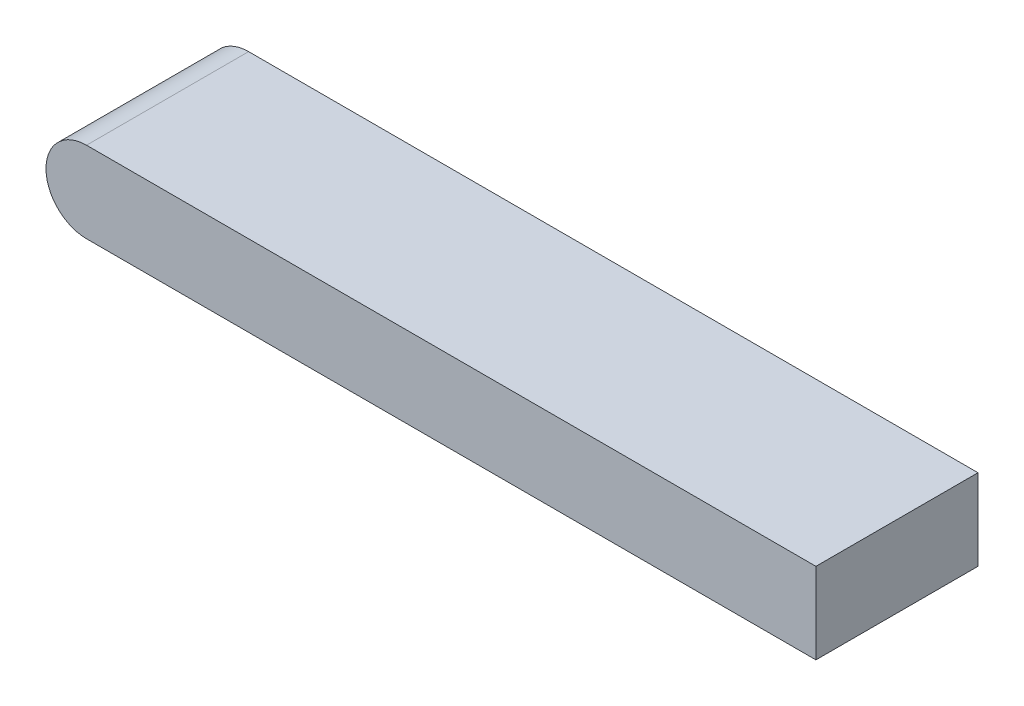
ISO-10303-21;
HEADER;
FILE_DESCRIPTION(('STEP AP214'),'2;1');
FILE_NAME('part.step','',(''),(''),'','','');
FILE_SCHEMA(('AUTOMOTIVE_DESIGN { 1 0 10303 214 1 1 1 1 }'));
ENDSEC;
DATA;
#1=APPLICATION_CONTEXT('core data for automotive mechanical design processes');
#2=APPLICATION_PROTOCOL_DEFINITION('international standard','automotive_design',2000,#1);
#3=PRODUCT_CONTEXT('',#1,'mechanical');
#4=PRODUCT('Part','Part','',(#3));
#5=PRODUCT_RELATED_PRODUCT_CATEGORY('part','',(#4));
#6=PRODUCT_DEFINITION_FORMATION('','',#4);
#7=PRODUCT_DEFINITION_CONTEXT('part definition',#1,'design');
#8=PRODUCT_DEFINITION('design','',#6,#7);
#9=PRODUCT_DEFINITION_SHAPE('','',#8);
#10=(LENGTH_UNIT() NAMED_UNIT(*) SI_UNIT(.MILLI.,.METRE.));
#11=(NAMED_UNIT(*) PLANE_ANGLE_UNIT() SI_UNIT($,.RADIAN.));
#12=(NAMED_UNIT(*) SI_UNIT($,.STERADIAN.) SOLID_ANGLE_UNIT());
#13=UNCERTAINTY_MEASURE_WITH_UNIT(LENGTH_MEASURE(1.E-05),#10,'distance_accuracy_value','');
#14=(GEOMETRIC_REPRESENTATION_CONTEXT(3) GLOBAL_UNCERTAINTY_ASSIGNED_CONTEXT((#13)) GLOBAL_UNIT_ASSIGNED_CONTEXT((#10,
#11,#12)) REPRESENTATION_CONTEXT('',''));
#15=CARTESIAN_POINT('',(0.,0.,0.));
#16=DIRECTION('',(0.,0.,1.));
#17=DIRECTION('',(1.,0.,0.));
#18=AXIS2_PLACEMENT_3D('',#15,#16,#17);
#19=CARTESIAN_POINT('',(-26.,4.,4.));
#20=DIRECTION('',(0.,0.,-1.));
#21=DIRECTION('',(-1.,0.,0.));
#22=AXIS2_PLACEMENT_3D('',#19,#20,#21);
#23=PLANE('',#22);
#24=DIRECTION('',(1.,0.,0.));
#25=VECTOR('',#24,1.);
#26=CARTESIAN_POINT('',(-26.,4.,4.));
#27=LINE('',#26,#25);
#28=CARTESIAN_POINT('',(-26.,4.,4.));
#29=VERTEX_POINT('',#28);
#30=CARTESIAN_POINT('',(10.,4.,4.));
#31=VERTEX_POINT('',#30);
#32=EDGE_CURVE('E79',#29,#31,#27,.T.);
#33=ORIENTED_EDGE('',*,*,#32,.F.);
#34=CARTESIAN_POINT('',(-26.,2.,4.));
#35=DIRECTION('',(0.,0.,1.));
#36=DIRECTION('',(1.,0.,0.));
#37=AXIS2_PLACEMENT_3D('',#34,#35,#36);
#38=CIRCLE('',#37,2.);
#39=CARTESIAN_POINT('',(-26.,0.,4.));
#40=VERTEX_POINT('',#39);
#41=EDGE_CURVE('E92',#29,#40,#38,.T.);
#42=ORIENTED_EDGE('',*,*,#41,.T.);
#43=DIRECTION('',(1.,0.,0.));
#44=VECTOR('',#43,1.);
#45=CARTESIAN_POINT('',(-26.,0.,4.));
#46=LINE('',#45,#44);
#47=CARTESIAN_POINT('',(10.,0.,4.));
#48=VERTEX_POINT('',#47);
#49=EDGE_CURVE('E83',#40,#48,#46,.T.);
#50=ORIENTED_EDGE('',*,*,#49,.T.);
#51=DIRECTION('',(0.,-1.,0.));
#52=VECTOR('',#51,1.);
#53=CARTESIAN_POINT('',(10.,4.,4.));
#54=LINE('',#53,#52);
#55=EDGE_CURVE('E11',#31,#48,#54,.T.);
#56=ORIENTED_EDGE('',*,*,#55,.F.);
#57=EDGE_LOOP('',(#33,#42,#50,#56));
#58=FACE_BOUND('',#57,.T.);
#59=ADVANCED_FACE('F34',(#58),#23,.F.);
#60=CARTESIAN_POINT('',(10.,4.,-4.));
#61=DIRECTION('',(-1.,0.,0.));
#62=DIRECTION('',(0.,0.,1.));
#63=AXIS2_PLACEMENT_3D('',#60,#61,#62);
#64=PLANE('',#63);
#65=DIRECTION('',(0.,0.,-1.));
#66=VECTOR('',#65,1.);
#67=CARTESIAN_POINT('',(10.,0.,-4.));
#68=LINE('',#67,#66);
#69=CARTESIAN_POINT('',(10.,0.,-4.));
#70=VERTEX_POINT('',#69);
#71=EDGE_CURVE('E64',#48,#70,#68,.T.);
#72=ORIENTED_EDGE('',*,*,#71,.T.);
#73=DIRECTION('',(0.,-1.,0.));
#74=VECTOR('',#73,1.);
#75=CARTESIAN_POINT('',(10.,4.,-4.));
#76=LINE('',#75,#74);
#77=CARTESIAN_POINT('',(10.,4.,-4.));
#78=VERTEX_POINT('',#77);
#79=EDGE_CURVE('E42',#78,#70,#76,.T.);
#80=ORIENTED_EDGE('',*,*,#79,.F.);
#81=DIRECTION('',(0.,0.,-1.));
#82=VECTOR('',#81,1.);
#83=CARTESIAN_POINT('',(10.,4.,-4.));
#84=LINE('',#83,#82);
#85=EDGE_CURVE('E101',#31,#78,#84,.T.);
#86=ORIENTED_EDGE('',*,*,#85,.F.);
#87=ORIENTED_EDGE('',*,*,#55,.T.);
#88=EDGE_LOOP('',(#72,#80,#86,#87));
#89=FACE_BOUND('',#88,.T.);
#90=ADVANCED_FACE('F107',(#89),#64,.F.);
#91=CARTESIAN_POINT('',(-26.,4.,-4.));
#92=DIRECTION('',(0.,0.,1.));
#93=DIRECTION('',(1.,0.,0.));
#94=AXIS2_PLACEMENT_3D('',#91,#92,#93);
#95=PLANE('',#94);
#96=DIRECTION('',(-1.,0.,0.));
#97=VECTOR('',#96,1.);
#98=CARTESIAN_POINT('',(-26.,0.,-4.));
#99=LINE('',#98,#97);
#100=CARTESIAN_POINT('',(-26.,0.,-4.));
#101=VERTEX_POINT('',#100);
#102=EDGE_CURVE('E71',#70,#101,#99,.T.);
#103=ORIENTED_EDGE('',*,*,#102,.T.);
#104=CARTESIAN_POINT('',(-26.,2.,-4.));
#105=DIRECTION('',(0.,0.,1.));
#106=DIRECTION('',(1.,0.,0.));
#107=AXIS2_PLACEMENT_3D('',#104,#105,#106);
#108=CIRCLE('',#107,2.);
#109=CARTESIAN_POINT('',(-26.,4.,-4.));
#110=VERTEX_POINT('',#109);
#111=EDGE_CURVE('E93',#110,#101,#108,.T.);
#112=ORIENTED_EDGE('',*,*,#111,.F.);
#113=DIRECTION('',(-1.,0.,0.));
#114=VECTOR('',#113,1.);
#115=CARTESIAN_POINT('',(-26.,4.,-4.));
#116=LINE('',#115,#114);
#117=EDGE_CURVE('E50',#78,#110,#116,.T.);
#118=ORIENTED_EDGE('',*,*,#117,.F.);
#119=ORIENTED_EDGE('',*,*,#79,.T.);
#120=EDGE_LOOP('',(#103,#112,#118,#119));
#121=FACE_BOUND('',#120,.T.);
#122=ADVANCED_FACE('F105',(#121),#95,.F.);
#123=CARTESIAN_POINT('',(0.,4.,0.));
#124=DIRECTION('',(0.,1.,0.));
#125=DIRECTION('',(0.,0.,1.));
#126=AXIS2_PLACEMENT_3D('',#123,#124,#125);
#127=PLANE('',#126);
#128=DIRECTION('',(0.,0.,1.));
#129=VECTOR('',#128,1.);
#130=CARTESIAN_POINT('',(-26.,4.,-4.));
#131=LINE('',#130,#129);
#132=EDGE_CURVE('E98',#110,#29,#131,.T.);
#133=ORIENTED_EDGE('',*,*,#132,.T.);
#134=ORIENTED_EDGE('',*,*,#32,.T.);
#135=ORIENTED_EDGE('',*,*,#85,.T.);
#136=ORIENTED_EDGE('',*,*,#117,.T.);
#137=EDGE_LOOP('',(#133,#134,#135,#136));
#138=FACE_BOUND('',#137,.T.);
#139=ADVANCED_FACE('F108',(#138),#127,.T.);
#140=CARTESIAN_POINT('',(0.,0.,0.));
#141=DIRECTION('',(0.,1.,0.));
#142=DIRECTION('',(0.,0.,1.));
#143=AXIS2_PLACEMENT_3D('',#140,#141,#142);
#144=PLANE('',#143);
#145=DIRECTION('',(0.,0.,1.));
#146=VECTOR('',#145,1.);
#147=CARTESIAN_POINT('',(-26.,0.,-4.));
#148=LINE('',#147,#146);
#149=EDGE_CURVE('E86',#101,#40,#148,.T.);
#150=ORIENTED_EDGE('',*,*,#149,.F.);
#151=ORIENTED_EDGE('',*,*,#102,.F.);
#152=ORIENTED_EDGE('',*,*,#71,.F.);
#153=ORIENTED_EDGE('',*,*,#49,.F.);
#154=EDGE_LOOP('',(#150,#151,#152,#153));
#155=FACE_BOUND('',#154,.T.);
#156=ADVANCED_FACE('F85',(#155),#144,.F.);
#157=CARTESIAN_POINT('',(-26.,2.,-4.));
#158=DIRECTION('',(0.,0.,1.));
#159=DIRECTION('',(1.,0.,0.));
#160=AXIS2_PLACEMENT_3D('',#157,#158,#159);
#161=CYLINDRICAL_SURFACE('',#160,2.);
#162=ORIENTED_EDGE('',*,*,#132,.F.);
#163=ORIENTED_EDGE('',*,*,#111,.T.);
#164=ORIENTED_EDGE('',*,*,#149,.T.);
#165=ORIENTED_EDGE('',*,*,#41,.F.);
#166=EDGE_LOOP('',(#162,#163,#164,#165));
#167=FACE_BOUND('',#166,.T.);
#168=ADVANCED_FACE('F91',(#167),#161,.T.);
#169=CLOSED_SHELL('',(#59,#90,#122,#139,#156,#168));
#170=MANIFOLD_SOLID_BREP('B2',#169);
#171=ADVANCED_BREP_SHAPE_REPRESENTATION('',(#18,#170),#14);
#172=SHAPE_DEFINITION_REPRESENTATION(#9,#171);
ENDSEC;
END-ISO-10303-21;
